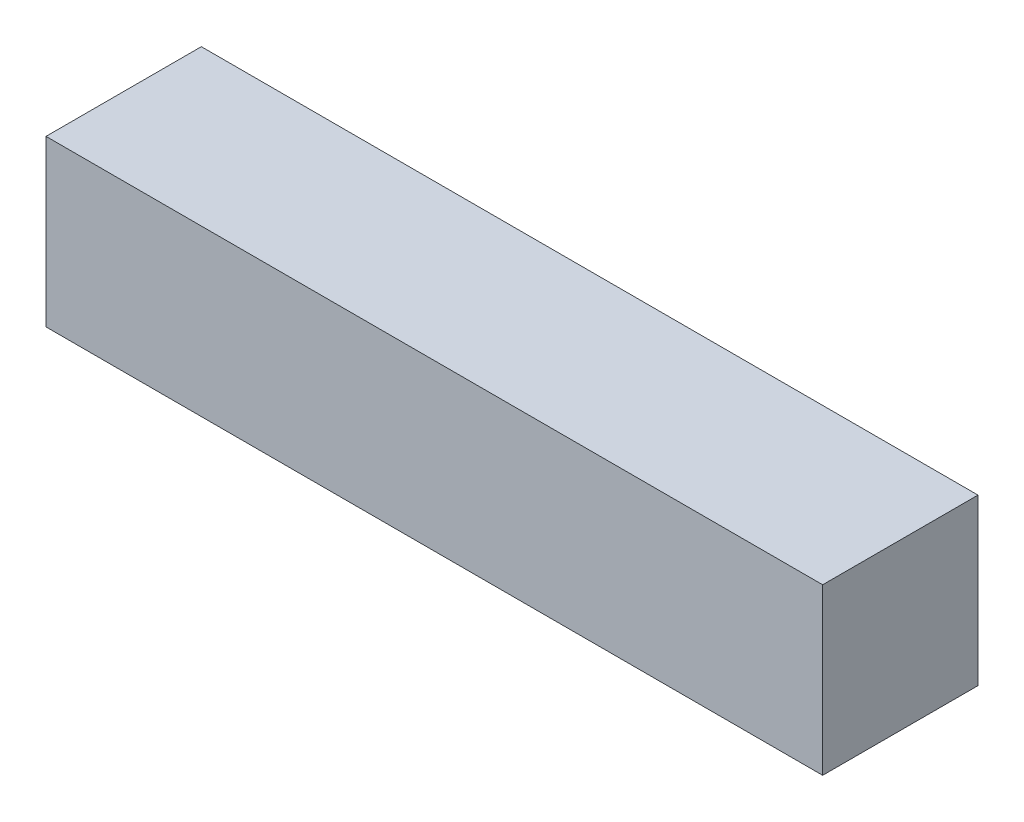
ISO-10303-21;
HEADER;
FILE_DESCRIPTION(('STEP AP214'),'2;1');
FILE_NAME('part.step','',(''),(''),'','','');
FILE_SCHEMA(('AUTOMOTIVE_DESIGN { 1 0 10303 214 1 1 1 1 }'));
ENDSEC;
DATA;
#1=APPLICATION_CONTEXT('core data for automotive mechanical design processes');
#2=APPLICATION_PROTOCOL_DEFINITION('international standard','automotive_design',2000,#1);
#3=PRODUCT_CONTEXT('',#1,'mechanical');
#4=PRODUCT('Part','Part','',(#3));
#5=PRODUCT_RELATED_PRODUCT_CATEGORY('part','',(#4));
#6=PRODUCT_DEFINITION_FORMATION('','',#4);
#7=PRODUCT_DEFINITION_CONTEXT('part definition',#1,'design');
#8=PRODUCT_DEFINITION('design','',#6,#7);
#9=PRODUCT_DEFINITION_SHAPE('','',#8);
#10=(LENGTH_UNIT() NAMED_UNIT(*) SI_UNIT(.MILLI.,.METRE.));
#11=(NAMED_UNIT(*) PLANE_ANGLE_UNIT() SI_UNIT($,.RADIAN.));
#12=(NAMED_UNIT(*) SI_UNIT($,.STERADIAN.) SOLID_ANGLE_UNIT());
#13=UNCERTAINTY_MEASURE_WITH_UNIT(LENGTH_MEASURE(1.E-05),#10,'distance_accuracy_value','');
#14=(GEOMETRIC_REPRESENTATION_CONTEXT(3) GLOBAL_UNCERTAINTY_ASSIGNED_CONTEXT((#13)) GLOBAL_UNIT_ASSIGNED_CONTEXT((#10,
#11,#12)) REPRESENTATION_CONTEXT('',''));
#15=CARTESIAN_POINT('',(0.,0.,0.));
#16=DIRECTION('',(0.,0.,1.));
#17=DIRECTION('',(1.,0.,0.));
#18=AXIS2_PLACEMENT_3D('',#15,#16,#17);
#19=CARTESIAN_POINT('',(0.,2590.8,0.));
#20=DIRECTION('',(1.,0.,0.));
#21=DIRECTION('',(0.,0.,-1.));
#22=AXIS2_PLACEMENT_3D('',#19,#20,#21);
#23=PLANE('',#22);
#24=DIRECTION('',(0.,0.,1.));
#25=VECTOR('',#24,1.);
#26=CARTESIAN_POINT('',(0.,0.,0.));
#27=LINE('',#26,#25);
#28=CARTESIAN_POINT('',(0.,0.,0.));
#29=VERTEX_POINT('',#28);
#30=CARTESIAN_POINT('',(2.98617875504091E-13,0.,2438.4));
#31=VERTEX_POINT('',#30);
#32=EDGE_CURVE('E164',#29,#31,#27,.T.);
#33=ORIENTED_EDGE('',*,*,#32,.T.);
#34=DIRECTION('',(0.,-1.,0.));
#35=VECTOR('',#34,1.);
#36=CARTESIAN_POINT('',(2.98617875504091E-13,2590.8,2438.4));
#37=LINE('',#36,#35);
#38=CARTESIAN_POINT('',(2.98617875504091E-13,2590.8,2438.4));
#39=VERTEX_POINT('',#38);
#40=EDGE_CURVE('E11',#39,#31,#37,.T.);
#41=ORIENTED_EDGE('',*,*,#40,.F.);
#42=DIRECTION('',(0.,0.,1.));
#43=VECTOR('',#42,1.);
#44=CARTESIAN_POINT('',(0.,2590.8,0.));
#45=LINE('',#44,#43);
#46=CARTESIAN_POINT('',(0.,2590.8,0.));
#47=VERTEX_POINT('',#46);
#48=EDGE_CURVE('E170',#47,#39,#45,.T.);
#49=ORIENTED_EDGE('',*,*,#48,.F.);
#50=DIRECTION('',(0.,-1.,0.));
#51=VECTOR('',#50,1.);
#52=CARTESIAN_POINT('',(0.,2590.8,0.));
#53=LINE('',#52,#51);
#54=EDGE_CURVE('E180',#47,#29,#53,.T.);
#55=ORIENTED_EDGE('',*,*,#54,.T.);
#56=EDGE_LOOP('',(#33,#41,#49,#55));
#57=FACE_BOUND('',#56,.T.);
#58=ADVANCED_FACE('F40',(#57),#23,.F.);
#59=CARTESIAN_POINT('',(2.98617875504091E-13,2590.8,2438.4));
#60=DIRECTION('',(0.,0.,-1.));
#61=DIRECTION('',(-1.,0.,0.));
#62=AXIS2_PLACEMENT_3D('',#59,#60,#61);
#63=PLANE('',#62);
#64=DIRECTION('',(1.,0.,0.));
#65=VECTOR('',#64,1.);
#66=CARTESIAN_POINT('',(2.98617875504091E-13,0.,2438.4));
#67=LINE('',#66,#65);
#68=CARTESIAN_POINT('',(12192.,0.,2438.4));
#69=VERTEX_POINT('',#68);
#70=EDGE_CURVE('E184',#31,#69,#67,.T.);
#71=ORIENTED_EDGE('',*,*,#70,.T.);
#72=DIRECTION('',(0.,-1.,0.));
#73=VECTOR('',#72,1.);
#74=CARTESIAN_POINT('',(12192.,2590.8,2438.4));
#75=LINE('',#74,#73);
#76=CARTESIAN_POINT('',(12192.,2590.8,2438.4));
#77=VERTEX_POINT('',#76);
#78=EDGE_CURVE('E49',#77,#69,#75,.T.);
#79=ORIENTED_EDGE('',*,*,#78,.F.);
#80=DIRECTION('',(1.,0.,0.));
#81=VECTOR('',#80,1.);
#82=CARTESIAN_POINT('',(2.98617875504091E-13,2590.8,2438.4));
#83=LINE('',#82,#81);
#84=EDGE_CURVE('E88',#39,#77,#83,.T.);
#85=ORIENTED_EDGE('',*,*,#84,.F.);
#86=ORIENTED_EDGE('',*,*,#40,.T.);
#87=EDGE_LOOP('',(#71,#79,#85,#86));
#88=FACE_BOUND('',#87,.T.);
#89=ADVANCED_FACE('F213',(#88),#63,.F.);
#90=CARTESIAN_POINT('',(12192.,2590.8,0.));
#91=DIRECTION('',(-1.,0.,0.));
#92=DIRECTION('',(0.,0.,1.));
#93=AXIS2_PLACEMENT_3D('',#90,#91,#92);
#94=PLANE('',#93);
#95=DIRECTION('',(0.,0.,-1.));
#96=VECTOR('',#95,1.);
#97=CARTESIAN_POINT('',(12192.,0.,0.));
#98=LINE('',#97,#96);
#99=CARTESIAN_POINT('',(12192.,0.,0.));
#100=VERTEX_POINT('',#99);
#101=EDGE_CURVE('E75',#69,#100,#98,.T.);
#102=ORIENTED_EDGE('',*,*,#101,.T.);
#103=DIRECTION('',(0.,-1.,0.));
#104=VECTOR('',#103,1.);
#105=CARTESIAN_POINT('',(12192.,2590.8,0.));
#106=LINE('',#105,#104);
#107=CARTESIAN_POINT('',(12192.,2590.8,0.));
#108=VERTEX_POINT('',#107);
#109=EDGE_CURVE('E193',#108,#100,#106,.T.);
#110=ORIENTED_EDGE('',*,*,#109,.F.);
#111=DIRECTION('',(0.,0.,-1.));
#112=VECTOR('',#111,1.);
#113=CARTESIAN_POINT('',(12192.,2590.8,0.));
#114=LINE('',#113,#112);
#115=EDGE_CURVE('E175',#77,#108,#114,.T.);
#116=ORIENTED_EDGE('',*,*,#115,.F.);
#117=ORIENTED_EDGE('',*,*,#78,.T.);
#118=EDGE_LOOP('',(#102,#110,#116,#117));
#119=FACE_BOUND('',#118,.T.);
#120=ADVANCED_FACE('F197',(#119),#94,.F.);
#121=CARTESIAN_POINT('',(0.,2590.8,0.));
#122=DIRECTION('',(0.,0.,1.));
#123=DIRECTION('',(1.,0.,0.));
#124=AXIS2_PLACEMENT_3D('',#121,#122,#123);
#125=PLANE('',#124);
#126=DIRECTION('',(-1.,0.,0.));
#127=VECTOR('',#126,1.);
#128=CARTESIAN_POINT('',(0.,0.,0.));
#129=LINE('',#128,#127);
#130=EDGE_CURVE('E81',#100,#29,#129,.T.);
#131=ORIENTED_EDGE('',*,*,#130,.T.);
#132=ORIENTED_EDGE('',*,*,#54,.F.);
#133=DIRECTION('',(-1.,0.,0.));
#134=VECTOR('',#133,1.);
#135=CARTESIAN_POINT('',(0.,2590.8,0.));
#136=LINE('',#135,#134);
#137=EDGE_CURVE('E57',#108,#47,#136,.T.);
#138=ORIENTED_EDGE('',*,*,#137,.F.);
#139=ORIENTED_EDGE('',*,*,#109,.T.);
#140=EDGE_LOOP('',(#131,#132,#138,#139));
#141=FACE_BOUND('',#140,.T.);
#142=ADVANCED_FACE('F204',(#141),#125,.F.);
#143=CARTESIAN_POINT('',(0.,2590.8,0.));
#144=DIRECTION('',(0.,1.,0.));
#145=DIRECTION('',(0.,0.,1.));
#146=AXIS2_PLACEMENT_3D('',#143,#144,#145);
#147=PLANE('',#146);
#148=ORIENTED_EDGE('',*,*,#48,.T.);
#149=ORIENTED_EDGE('',*,*,#84,.T.);
#150=ORIENTED_EDGE('',*,*,#115,.T.);
#151=ORIENTED_EDGE('',*,*,#137,.T.);
#152=EDGE_LOOP('',(#148,#149,#150,#151));
#153=FACE_BOUND('',#152,.T.);
#154=ADVANCED_FACE('F206',(#153),#147,.T.);
#155=CARTESIAN_POINT('',(0.,0.,0.));
#156=DIRECTION('',(0.,1.,0.));
#157=DIRECTION('',(0.,0.,1.));
#158=AXIS2_PLACEMENT_3D('',#155,#156,#157);
#159=PLANE('',#158);
#160=ORIENTED_EDGE('',*,*,#32,.F.);
#161=ORIENTED_EDGE('',*,*,#130,.F.);
#162=ORIENTED_EDGE('',*,*,#101,.F.);
#163=ORIENTED_EDGE('',*,*,#70,.F.);
#164=EDGE_LOOP('',(#160,#161,#162,#163));
#165=FACE_BOUND('',#164,.T.);
#166=ADVANCED_FACE('F200',(#165),#159,.F.);
#167=CLOSED_SHELL('',(#58,#89,#120,#142,#154,#166));
#168=CARTESIAN_POINT('',(12115.8,2413.,50.7999999999985));
#169=DIRECTION('',(0.,0.,-1.));
#170=DIRECTION('',(-1.,0.,0.));
#171=AXIS2_PLACEMENT_3D('',#168,#169,#170);
#172=PLANE('',#171);
#173=DIRECTION('',(0.,-1.,0.));
#174=VECTOR('',#173,1.);
#175=CARTESIAN_POINT('',(76.2,2413.,50.8));
#176=LINE('',#175,#174);
#177=CARTESIAN_POINT('',(76.2,2413.,50.8));
#178=VERTEX_POINT('',#177);
#179=CARTESIAN_POINT('',(76.2,177.8,50.8000000000003));
#180=VERTEX_POINT('',#179);
#181=EDGE_CURVE('E122',#178,#180,#176,.T.);
#182=ORIENTED_EDGE('',*,*,#181,.T.);
#183=DIRECTION('',(-1.,0.,0.));
#184=VECTOR('',#183,1.);
#185=CARTESIAN_POINT('',(12115.8,177.8,50.7999999999988));
#186=LINE('',#185,#184);
#187=CARTESIAN_POINT('',(12115.8,177.8,50.7999999999988));
#188=VERTEX_POINT('',#187);
#189=EDGE_CURVE('E115',#188,#180,#186,.T.);
#190=ORIENTED_EDGE('',*,*,#189,.F.);
#191=DIRECTION('',(0.,-1.,0.));
#192=VECTOR('',#191,1.);
#193=CARTESIAN_POINT('',(12115.8,2413.,50.7999999999985));
#194=LINE('',#193,#192);
#195=CARTESIAN_POINT('',(12115.8,2413.,50.7999999999985));
#196=VERTEX_POINT('',#195);
#197=EDGE_CURVE('E119',#196,#188,#194,.T.);
#198=ORIENTED_EDGE('',*,*,#197,.F.);
#199=DIRECTION('',(-1.,0.,0.));
#200=VECTOR('',#199,1.);
#201=CARTESIAN_POINT('',(12115.8,2413.,50.7999999999985));
#202=LINE('',#201,#200);
#203=EDGE_CURVE('E161',#196,#178,#202,.T.);
#204=ORIENTED_EDGE('',*,*,#203,.T.);
#205=EDGE_LOOP('',(#182,#190,#198,#204));
#206=FACE_BOUND('',#205,.T.);
#207=ADVANCED_FACE('F117',(#206),#172,.F.);
#208=CARTESIAN_POINT('',(12115.8,2413.,50.7999999999985));
#209=DIRECTION('',(0.,1.,0.));
#210=DIRECTION('',(0.,0.,1.));
#211=AXIS2_PLACEMENT_3D('',#208,#209,#210);
#212=PLANE('',#211);
#213=DIRECTION('',(0.,0.,-1.));
#214=VECTOR('',#213,1.);
#215=CARTESIAN_POINT('',(76.2,2413.,50.8));
#216=LINE('',#215,#214);
#217=CARTESIAN_POINT('',(76.2000000000003,2413.,2387.6));
#218=VERTEX_POINT('',#217);
#219=EDGE_CURVE('E142',#218,#178,#216,.T.);
#220=ORIENTED_EDGE('',*,*,#219,.T.);
#221=ORIENTED_EDGE('',*,*,#203,.F.);
#222=DIRECTION('',(0.,0.,-1.));
#223=VECTOR('',#222,1.);
#224=CARTESIAN_POINT('',(12115.8,2413.,50.7999999999985));
#225=LINE('',#224,#223);
#226=CARTESIAN_POINT('',(12115.8,2413.,2387.6));
#227=VERTEX_POINT('',#226);
#228=EDGE_CURVE('E128',#227,#196,#225,.T.);
#229=ORIENTED_EDGE('',*,*,#228,.F.);
#230=DIRECTION('',(-1.,0.,0.));
#231=VECTOR('',#230,1.);
#232=CARTESIAN_POINT('',(12115.8,2413.,2387.6));
#233=LINE('',#232,#231);
#234=EDGE_CURVE('E165',#227,#218,#233,.T.);
#235=ORIENTED_EDGE('',*,*,#234,.T.);
#236=EDGE_LOOP('',(#220,#221,#229,#235));
#237=FACE_BOUND('',#236,.T.);
#238=ADVANCED_FACE('F252',(#237),#212,.F.);
#239=CARTESIAN_POINT('',(12115.8,2413.,2387.6));
#240=DIRECTION('',(0.,0.,1.));
#241=DIRECTION('',(0.,-1.,0.));
#242=AXIS2_PLACEMENT_3D('',#239,#240,#241);
#243=PLANE('',#242);
#244=DIRECTION('',(0.,1.,0.));
#245=VECTOR('',#244,1.);
#246=CARTESIAN_POINT('',(76.2000000000003,2413.,2387.6));
#247=LINE('',#246,#245);
#248=CARTESIAN_POINT('',(76.2000000000003,177.8,2387.6));
#249=VERTEX_POINT('',#248);
#250=EDGE_CURVE('E146',#249,#218,#247,.T.);
#251=ORIENTED_EDGE('',*,*,#250,.T.);
#252=ORIENTED_EDGE('',*,*,#234,.F.);
#253=DIRECTION('',(0.,1.,0.));
#254=VECTOR('',#253,1.);
#255=CARTESIAN_POINT('',(12115.8,2413.,2387.6));
#256=LINE('',#255,#254);
#257=CARTESIAN_POINT('',(12115.8,177.8,2387.6));
#258=VERTEX_POINT('',#257);
#259=EDGE_CURVE('E137',#258,#227,#256,.T.);
#260=ORIENTED_EDGE('',*,*,#259,.F.);
#261=DIRECTION('',(-1.,0.,0.));
#262=VECTOR('',#261,1.);
#263=CARTESIAN_POINT('',(12115.8,177.8,2387.6));
#264=LINE('',#263,#262);
#265=EDGE_CURVE('E127',#258,#249,#264,.T.);
#266=ORIENTED_EDGE('',*,*,#265,.T.);
#267=EDGE_LOOP('',(#251,#252,#260,#266));
#268=FACE_BOUND('',#267,.T.);
#269=ADVANCED_FACE('F262',(#268),#243,.F.);
#270=CARTESIAN_POINT('',(12115.8,177.8,50.7999999999988));
#271=DIRECTION('',(0.,-1.,0.));
#272=DIRECTION('',(0.,0.,-1.));
#273=AXIS2_PLACEMENT_3D('',#270,#271,#272);
#274=PLANE('',#273);
#275=DIRECTION('',(0.,0.,1.));
#276=VECTOR('',#275,1.);
#277=CARTESIAN_POINT('',(76.2,177.8,50.8000000000003));
#278=LINE('',#277,#276);
#279=EDGE_CURVE('E155',#180,#249,#278,.T.);
#280=ORIENTED_EDGE('',*,*,#279,.T.);
#281=ORIENTED_EDGE('',*,*,#265,.F.);
#282=DIRECTION('',(0.,0.,1.));
#283=VECTOR('',#282,1.);
#284=CARTESIAN_POINT('',(12115.8,177.8,50.7999999999988));
#285=LINE('',#284,#283);
#286=EDGE_CURVE('E131',#188,#258,#285,.T.);
#287=ORIENTED_EDGE('',*,*,#286,.F.);
#288=ORIENTED_EDGE('',*,*,#189,.T.);
#289=EDGE_LOOP('',(#280,#281,#287,#288));
#290=FACE_BOUND('',#289,.T.);
#291=ADVANCED_FACE('F132',(#290),#274,.F.);
#292=CARTESIAN_POINT('',(12115.8,0.,-1.48392902803941E-12));
#293=DIRECTION('',(-1.,0.,0.));
#294=DIRECTION('',(0.,0.,1.));
#295=AXIS2_PLACEMENT_3D('',#292,#293,#294);
#296=PLANE('',#295);
#297=ORIENTED_EDGE('',*,*,#197,.T.);
#298=ORIENTED_EDGE('',*,*,#286,.T.);
#299=ORIENTED_EDGE('',*,*,#259,.T.);
#300=ORIENTED_EDGE('',*,*,#228,.T.);
#301=EDGE_LOOP('',(#297,#298,#299,#300));
#302=FACE_BOUND('',#301,.T.);
#303=ADVANCED_FACE('F139',(#302),#296,.T.);
#304=CARTESIAN_POINT('',(76.2,0.,0.));
#305=DIRECTION('',(-1.,0.,0.));
#306=DIRECTION('',(0.,0.,1.));
#307=AXIS2_PLACEMENT_3D('',#304,#305,#306);
#308=PLANE('',#307);
#309=ORIENTED_EDGE('',*,*,#181,.F.);
#310=ORIENTED_EDGE('',*,*,#219,.F.);
#311=ORIENTED_EDGE('',*,*,#250,.F.);
#312=ORIENTED_EDGE('',*,*,#279,.F.);
#313=EDGE_LOOP('',(#309,#310,#311,#312));
#314=FACE_BOUND('',#313,.T.);
#315=ADVANCED_FACE('F289',(#314),#308,.F.);
#316=CLOSED_SHELL('',(#207,#238,#269,#291,#303,#315));
#317=ORIENTED_CLOSED_SHELL('',*,#316,.T.);
#318=BREP_WITH_VOIDS('B2',#167,(#317));
#319=ADVANCED_BREP_SHAPE_REPRESENTATION('',(#18,#318),#14);
#320=SHAPE_DEFINITION_REPRESENTATION(#9,#319);
ENDSEC;
END-ISO-10303-21;
